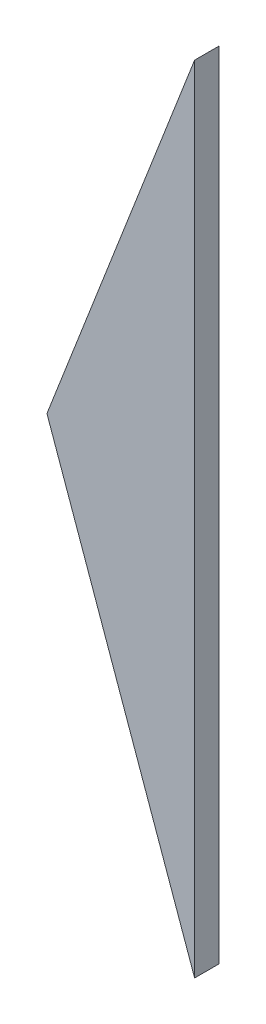
ISO-10303-21;
HEADER;
FILE_DESCRIPTION(('STEP AP214'),'2;1');
FILE_NAME('part.step','',(''),(''),'','','');
FILE_SCHEMA(('AUTOMOTIVE_DESIGN { 1 0 10303 214 1 1 1 1 }'));
ENDSEC;
DATA;
#1=APPLICATION_CONTEXT('core data for automotive mechanical design processes');
#2=APPLICATION_PROTOCOL_DEFINITION('international standard','automotive_design',2000,#1);
#3=PRODUCT_CONTEXT('',#1,'mechanical');
#4=PRODUCT('Part','Part','',(#3));
#5=PRODUCT_RELATED_PRODUCT_CATEGORY('part','',(#4));
#6=PRODUCT_DEFINITION_FORMATION('','',#4);
#7=PRODUCT_DEFINITION_CONTEXT('part definition',#1,'design');
#8=PRODUCT_DEFINITION('design','',#6,#7);
#9=PRODUCT_DEFINITION_SHAPE('','',#8);
#10=(LENGTH_UNIT() NAMED_UNIT(*) SI_UNIT(.MILLI.,.METRE.));
#11=(NAMED_UNIT(*) PLANE_ANGLE_UNIT() SI_UNIT($,.RADIAN.));
#12=(NAMED_UNIT(*) SI_UNIT($,.STERADIAN.) SOLID_ANGLE_UNIT());
#13=UNCERTAINTY_MEASURE_WITH_UNIT(LENGTH_MEASURE(1.E-05),#10,'distance_accuracy_value','');
#14=(GEOMETRIC_REPRESENTATION_CONTEXT(3) GLOBAL_UNCERTAINTY_ASSIGNED_CONTEXT((#13)) GLOBAL_UNIT_ASSIGNED_CONTEXT((#10,
#11,#12)) REPRESENTATION_CONTEXT('',''));
#15=CARTESIAN_POINT('',(0.,0.,0.));
#16=DIRECTION('',(0.,0.,1.));
#17=DIRECTION('',(1.,0.,0.));
#18=AXIS2_PLACEMENT_3D('',#15,#16,#17);
#19=CARTESIAN_POINT('',(-7.6269772099542,-117.134669827765,-3.));
#20=DIRECTION('',(-0.942132692088366,-0.335240198213652,0.));
#21=DIRECTION('',(0.335240198213652,-0.942132692088366,0.));
#22=AXIS2_PLACEMENT_3D('',#19,#20,#21);
#23=PLANE('',#22);
#24=DIRECTION('',(0.335240198213652,-0.942132692088366,0.));
#25=VECTOR('',#24,1.);
#26=CARTESIAN_POINT('',(-7.6269772099542,-117.134669827765,0.));
#27=LINE('',#26,#25);
#28=CARTESIAN_POINT('',(-25.7430664156187,-66.2226372481627,0.));
#29=VERTEX_POINT('',#28);
#30=CARTESIAN_POINT('',(-7.6269772099542,-117.134669827765,0.));
#31=VERTEX_POINT('',#30);
#32=EDGE_CURVE('E85',#29,#31,#27,.T.);
#33=ORIENTED_EDGE('',*,*,#32,.F.);
#34=DIRECTION('',(0.,0.,1.));
#35=VECTOR('',#34,1.);
#36=CARTESIAN_POINT('',(-25.7430664156187,-66.2226372481627,-3.));
#37=LINE('',#36,#35);
#38=CARTESIAN_POINT('',(-25.7430664156187,-66.2226372481627,-3.));
#39=VERTEX_POINT('',#38);
#40=EDGE_CURVE('E11',#39,#29,#37,.T.);
#41=ORIENTED_EDGE('',*,*,#40,.F.);
#42=DIRECTION('',(0.335240198213652,-0.942132692088366,0.));
#43=VECTOR('',#42,1.);
#44=CARTESIAN_POINT('',(-7.6269772099542,-117.134669827765,-3.));
#45=LINE('',#44,#43);
#46=CARTESIAN_POINT('',(-7.6269772099542,-117.134669827765,-3.));
#47=VERTEX_POINT('',#46);
#48=EDGE_CURVE('E77',#39,#47,#45,.T.);
#49=ORIENTED_EDGE('',*,*,#48,.T.);
#50=DIRECTION('',(0.,0.,1.));
#51=VECTOR('',#50,1.);
#52=CARTESIAN_POINT('',(-7.6269772099542,-117.134669827765,-3.));
#53=LINE('',#52,#51);
#54=EDGE_CURVE('E36',#47,#31,#53,.T.);
#55=ORIENTED_EDGE('',*,*,#54,.T.);
#56=EDGE_LOOP('',(#33,#41,#49,#55));
#57=FACE_BOUND('',#56,.T.);
#58=ADVANCED_FACE('F33',(#57),#23,.T.);
#59=CARTESIAN_POINT('',(-25.7430664156187,-66.2226372481627,-3.));
#60=DIRECTION('',(-0.932053069710606,0.362321784113289,0.));
#61=DIRECTION('',(-0.362321784113289,-0.932053069710606,0.));
#62=AXIS2_PLACEMENT_3D('',#59,#60,#61);
#63=PLANE('',#62);
#64=DIRECTION('',(-0.362321784113289,-0.932053069710606,0.));
#65=VECTOR('',#64,1.);
#66=CARTESIAN_POINT('',(-25.7430664156187,-66.2226372481627,0.));
#67=LINE('',#66,#65);
#68=CARTESIAN_POINT('',(-7.62697720995422,-19.6199837626324,0.));
#69=VERTEX_POINT('',#68);
#70=EDGE_CURVE('E79',#69,#29,#67,.T.);
#71=ORIENTED_EDGE('',*,*,#70,.F.);
#72=DIRECTION('',(0.,0.,1.));
#73=VECTOR('',#72,1.);
#74=CARTESIAN_POINT('',(-7.62697720995422,-19.6199837626324,-3.));
#75=LINE('',#74,#73);
#76=CARTESIAN_POINT('',(-7.62697720995422,-19.6199837626324,-3.));
#77=VERTEX_POINT('',#76);
#78=EDGE_CURVE('E42',#77,#69,#75,.T.);
#79=ORIENTED_EDGE('',*,*,#78,.F.);
#80=DIRECTION('',(-0.362321784113289,-0.932053069710606,0.));
#81=VECTOR('',#80,1.);
#82=CARTESIAN_POINT('',(-25.7430664156187,-66.2226372481627,-3.));
#83=LINE('',#82,#81);
#84=EDGE_CURVE('E74',#77,#39,#83,.T.);
#85=ORIENTED_EDGE('',*,*,#84,.T.);
#86=ORIENTED_EDGE('',*,*,#40,.T.);
#87=EDGE_LOOP('',(#71,#79,#85,#86));
#88=FACE_BOUND('',#87,.T.);
#89=ADVANCED_FACE('F89',(#88),#63,.T.);
#90=CARTESIAN_POINT('',(-7.62697720995422,-19.6199837626324,-3.));
#91=DIRECTION('',(1.,0.,0.));
#92=DIRECTION('',(0.,1.,0.));
#93=AXIS2_PLACEMENT_3D('',#90,#91,#92);
#94=PLANE('',#93);
#95=DIRECTION('',(0.,1.,0.));
#96=VECTOR('',#95,1.);
#97=CARTESIAN_POINT('',(-7.62697720995422,-19.6199837626324,0.));
#98=LINE('',#97,#96);
#99=EDGE_CURVE('E72',#31,#69,#98,.T.);
#100=ORIENTED_EDGE('',*,*,#99,.F.);
#101=ORIENTED_EDGE('',*,*,#54,.F.);
#102=DIRECTION('',(0.,1.,0.));
#103=VECTOR('',#102,1.);
#104=CARTESIAN_POINT('',(-7.62697720995422,-19.6199837626324,-3.));
#105=LINE('',#104,#103);
#106=EDGE_CURVE('E70',#47,#77,#105,.T.);
#107=ORIENTED_EDGE('',*,*,#106,.T.);
#108=ORIENTED_EDGE('',*,*,#78,.T.);
#109=EDGE_LOOP('',(#100,#101,#107,#108));
#110=FACE_BOUND('',#109,.T.);
#111=ADVANCED_FACE('F69',(#110),#94,.T.);
#112=CARTESIAN_POINT('',(0.,0.,-3.));
#113=DIRECTION('',(0.,0.,-1.));
#114=DIRECTION('',(-1.,0.,0.));
#115=AXIS2_PLACEMENT_3D('',#112,#113,#114);
#116=PLANE('',#115);
#117=ORIENTED_EDGE('',*,*,#48,.F.);
#118=ORIENTED_EDGE('',*,*,#84,.F.);
#119=ORIENTED_EDGE('',*,*,#106,.F.);
#120=EDGE_LOOP('',(#117,#118,#119));
#121=FACE_BOUND('',#120,.T.);
#122=ADVANCED_FACE('F76',(#121),#116,.T.);
#123=CARTESIAN_POINT('',(0.,0.,0.));
#124=DIRECTION('',(0.,0.,-1.));
#125=DIRECTION('',(-1.,0.,0.));
#126=AXIS2_PLACEMENT_3D('',#123,#124,#125);
#127=PLANE('',#126);
#128=ORIENTED_EDGE('',*,*,#32,.T.);
#129=ORIENTED_EDGE('',*,*,#99,.T.);
#130=ORIENTED_EDGE('',*,*,#70,.T.);
#131=EDGE_LOOP('',(#128,#129,#130));
#132=FACE_BOUND('',#131,.T.);
#133=ADVANCED_FACE('F88',(#132),#127,.F.);
#134=CLOSED_SHELL('',(#58,#89,#111,#122,#133));
#135=MANIFOLD_SOLID_BREP('B2',#134);
#136=ADVANCED_BREP_SHAPE_REPRESENTATION('',(#18,#135),#14);
#137=SHAPE_DEFINITION_REPRESENTATION(#9,#136);
ENDSEC;
END-ISO-10303-21;
